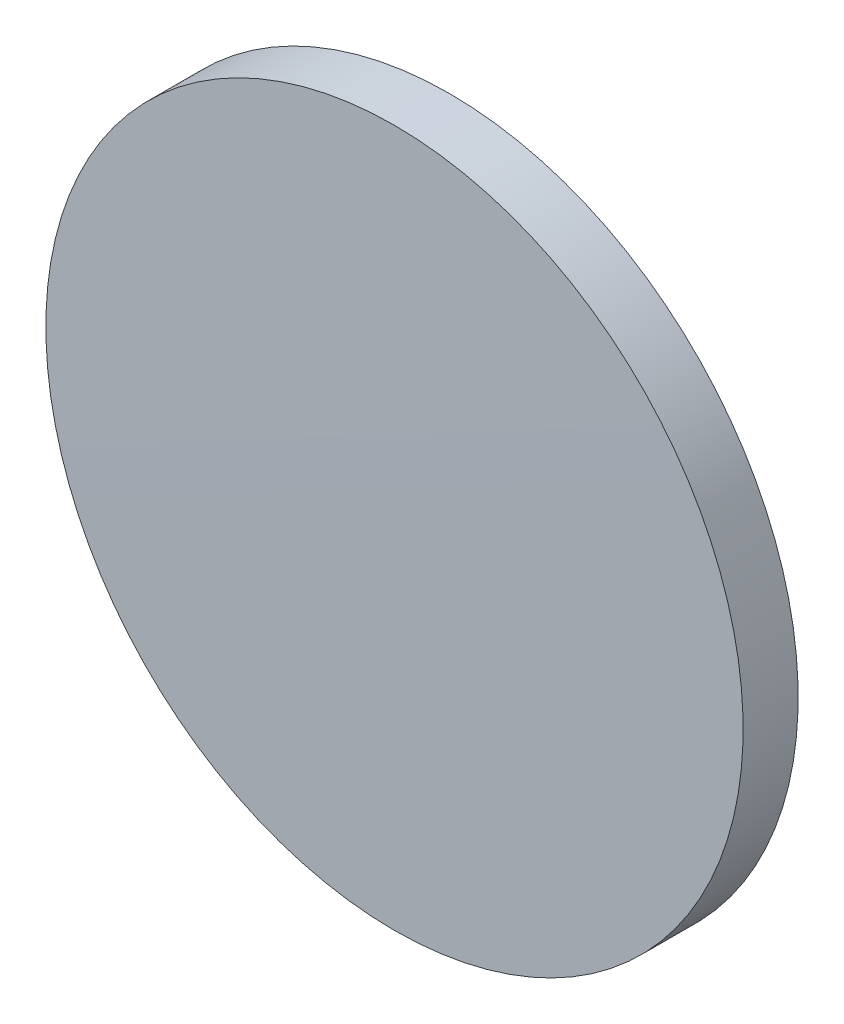
ISO-10303-21;
HEADER;
FILE_DESCRIPTION(('STEP AP214'),'2;1');
FILE_NAME('part.step','',(''),(''),'','','');
FILE_SCHEMA(('AUTOMOTIVE_DESIGN { 1 0 10303 214 1 1 1 1 }'));
ENDSEC;
DATA;
#1=APPLICATION_CONTEXT('core data for automotive mechanical design processes');
#2=APPLICATION_PROTOCOL_DEFINITION('international standard','automotive_design',2000,#1);
#3=PRODUCT_CONTEXT('',#1,'mechanical');
#4=PRODUCT('Part','Part','',(#3));
#5=PRODUCT_RELATED_PRODUCT_CATEGORY('part','',(#4));
#6=PRODUCT_DEFINITION_FORMATION('','',#4);
#7=PRODUCT_DEFINITION_CONTEXT('part definition',#1,'design');
#8=PRODUCT_DEFINITION('design','',#6,#7);
#9=PRODUCT_DEFINITION_SHAPE('','',#8);
#10=(LENGTH_UNIT() NAMED_UNIT(*) SI_UNIT(.MILLI.,.METRE.));
#11=(NAMED_UNIT(*) PLANE_ANGLE_UNIT() SI_UNIT($,.RADIAN.));
#12=(NAMED_UNIT(*) SI_UNIT($,.STERADIAN.) SOLID_ANGLE_UNIT());
#13=UNCERTAINTY_MEASURE_WITH_UNIT(LENGTH_MEASURE(1.E-05),#10,'distance_accuracy_value','');
#14=(GEOMETRIC_REPRESENTATION_CONTEXT(3) GLOBAL_UNCERTAINTY_ASSIGNED_CONTEXT((#13)) GLOBAL_UNIT_ASSIGNED_CONTEXT((#10,
#11,#12)) REPRESENTATION_CONTEXT('',''));
#15=CARTESIAN_POINT('',(0.,0.,0.));
#16=DIRECTION('',(0.,0.,1.));
#17=DIRECTION('',(1.,0.,0.));
#18=AXIS2_PLACEMENT_3D('',#15,#16,#17);
#19=CARTESIAN_POINT('',(0.,0.,-1.02));
#20=DIRECTION('',(0.,0.,-1.));
#21=DIRECTION('',(0.,1.,0.));
#22=AXIS2_PLACEMENT_3D('',#19,#20,#21);
#23=PLANE('',#22);
#24=CARTESIAN_POINT('',(0.,0.,-1.02));
#25=DIRECTION('',(0.,0.,-1.));
#26=DIRECTION('',(0.,1.,0.));
#27=AXIS2_PLACEMENT_3D('',#24,#25,#26);
#28=CIRCLE('',#27,12.7);
#29=CARTESIAN_POINT('',(0.,12.7,-1.02));
#30=VERTEX_POINT('',#29);
#31=EDGE_CURVE('E36',#30,#30,#28,.T.);
#32=ORIENTED_EDGE('',*,*,#31,.T.);
#33=EDGE_LOOP('',(#32));
#34=FACE_BOUND('',#33,.T.);
#35=ADVANCED_FACE('F30',(#34),#23,.T.);
#36=CARTESIAN_POINT('',(0.,2.75102796500146E-13,-2251.889));
#37=DIRECTION('',(0.,0.,-1.));
#38=DIRECTION('',(0.,1.,0.));
#39=AXIS2_PLACEMENT_3D('',#36,#37,#38);
#40=SPHERICAL_SURFACE('',#39,2252.909);
#41=CARTESIAN_POINT('',(0.,0.,0.984203773572996));
#42=DIRECTION('',(0.,0.,-1.));
#43=DIRECTION('',(0.,1.,0.));
#44=AXIS2_PLACEMENT_3D('',#41,#42,#43);
#45=CIRCLE('',#44,12.7);
#46=CARTESIAN_POINT('',(0.,12.7,0.984203773573));
#47=VERTEX_POINT('',#46);
#48=EDGE_CURVE('E10',#47,#47,#45,.T.);
#49=ORIENTED_EDGE('',*,*,#48,.F.);
#50=EDGE_LOOP('',(#49));
#51=FACE_BOUND('',#50,.T.);
#52=ADVANCED_FACE('F45',(#51),#40,.T.);
#53=CARTESIAN_POINT('',(0.,0.,-1.02));
#54=DIRECTION('',(0.,0.,-1.));
#55=DIRECTION('',(0.,1.,0.));
#56=AXIS2_PLACEMENT_3D('',#53,#54,#55);
#57=CYLINDRICAL_SURFACE('',#56,12.7);
#58=ORIENTED_EDGE('',*,*,#48,.T.);
#59=EDGE_LOOP('',(#58));
#60=FACE_BOUND('',#59,.T.);
#61=ORIENTED_EDGE('',*,*,#31,.F.);
#62=EDGE_LOOP('',(#61));
#63=FACE_BOUND('',#62,.T.);
#64=ADVANCED_FACE('F43',(#60,#63),#57,.T.);
#65=CLOSED_SHELL('',(#35,#52,#64));
#66=MANIFOLD_SOLID_BREP('B2',#65);
#67=ADVANCED_BREP_SHAPE_REPRESENTATION('',(#18,#66),#14);
#68=SHAPE_DEFINITION_REPRESENTATION(#9,#67);
ENDSEC;
END-ISO-10303-21;
